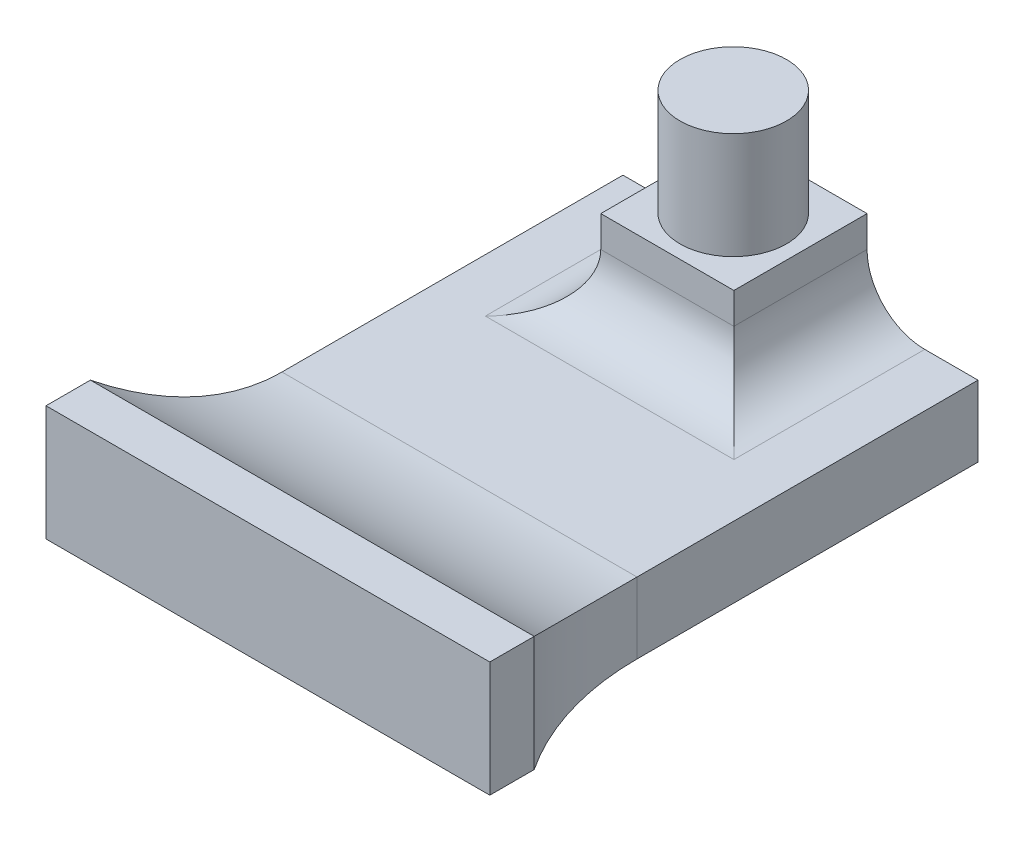
ISO-10303-21;
HEADER;
FILE_DESCRIPTION(('STEP AP214'),'2;1');
FILE_NAME('part.step','',(''),(''),'','','');
FILE_SCHEMA(('AUTOMOTIVE_DESIGN { 1 0 10303 214 1 1 1 1 }'));
ENDSEC;
DATA;
#1=APPLICATION_CONTEXT('core data for automotive mechanical design processes');
#2=APPLICATION_PROTOCOL_DEFINITION('international standard','automotive_design',2000,#1);
#3=PRODUCT_CONTEXT('',#1,'mechanical');
#4=PRODUCT('Part','Part','',(#3));
#5=PRODUCT_RELATED_PRODUCT_CATEGORY('part','',(#4));
#6=PRODUCT_DEFINITION_FORMATION('','',#4);
#7=PRODUCT_DEFINITION_CONTEXT('part definition',#1,'design');
#8=PRODUCT_DEFINITION('design','',#6,#7);
#9=PRODUCT_DEFINITION_SHAPE('','',#8);
#10=(LENGTH_UNIT() NAMED_UNIT(*) SI_UNIT(.MILLI.,.METRE.));
#11=(NAMED_UNIT(*) PLANE_ANGLE_UNIT() SI_UNIT($,.RADIAN.));
#12=(NAMED_UNIT(*) SI_UNIT($,.STERADIAN.) SOLID_ANGLE_UNIT());
#13=UNCERTAINTY_MEASURE_WITH_UNIT(LENGTH_MEASURE(1.E-05),#10,'distance_accuracy_value','');
#14=(GEOMETRIC_REPRESENTATION_CONTEXT(3) GLOBAL_UNCERTAINTY_ASSIGNED_CONTEXT((#13)) GLOBAL_UNIT_ASSIGNED_CONTEXT((#10,
#11,#12)) REPRESENTATION_CONTEXT('',''));
#15=CARTESIAN_POINT('',(0.,0.,0.));
#16=DIRECTION('',(0.,0.,1.));
#17=DIRECTION('',(1.,0.,0.));
#18=AXIS2_PLACEMENT_3D('',#15,#16,#17);
#19=CARTESIAN_POINT('',(-40.,0.,60.));
#20=DIRECTION('',(-1.,0.,0.));
#21=DIRECTION('',(0.,0.,1.));
#22=AXIS2_PLACEMENT_3D('',#19,#20,#21);
#23=PLANE('',#22);
#24=DIRECTION('',(0.,1.,0.));
#25=VECTOR('',#24,1.);
#26=CARTESIAN_POINT('',(-40.,0.,0.));
#27=LINE('',#26,#25);
#28=CARTESIAN_POINT('',(-40.,2.,0.));
#29=VERTEX_POINT('',#28);
#30=CARTESIAN_POINT('',(-40.,9.99999999999999,0.));
#31=VERTEX_POINT('',#30);
#32=EDGE_CURVE('E151',#29,#31,#27,.T.);
#33=ORIENTED_EDGE('',*,*,#32,.F.);
#34=DIRECTION('',(0.,0.,1.));
#35=VECTOR('',#34,1.);
#36=CARTESIAN_POINT('',(-40.,2.,60.));
#37=LINE('',#36,#35);
#38=CARTESIAN_POINT('',(-40.,1.99999999999999,38.416876048223));
#39=VERTEX_POINT('',#38);
#40=EDGE_CURVE('E141',#29,#39,#37,.T.);
#41=ORIENTED_EDGE('',*,*,#40,.T.);
#42=DIRECTION('',(0.,-1.,0.));
#43=VECTOR('',#42,1.);
#44=CARTESIAN_POINT('',(-40.,9.99999999999999,38.416876048223));
#45=LINE('',#44,#43);
#46=CARTESIAN_POINT('',(-40.,9.99999999999999,38.416876048223));
#47=VERTEX_POINT('',#46);
#48=EDGE_CURVE('E149',#39,#47,#45,.F.);
#49=ORIENTED_EDGE('',*,*,#48,.T.);
#50=DIRECTION('',(0.,0.,-1.));
#51=VECTOR('',#50,1.);
#52=CARTESIAN_POINT('',(-40.,9.99999999999999,60.));
#53=LINE('',#52,#51);
#54=EDGE_CURVE('E253',#47,#31,#53,.T.);
#55=ORIENTED_EDGE('',*,*,#54,.T.);
#56=EDGE_LOOP('',(#33,#41,#49,#55));
#57=FACE_BOUND('',#56,.T.);
#58=ADVANCED_FACE('F39',(#57),#23,.T.);
#59=CARTESIAN_POINT('',(0.,0.,60.));
#60=DIRECTION('',(-1.,0.,0.));
#61=DIRECTION('',(0.,-1.,0.));
#62=AXIS2_PLACEMENT_3D('',#59,#60,#61);
#63=PLANE('',#62);
#64=DIRECTION('',(0.,0.,1.));
#65=VECTOR('',#64,1.);
#66=CARTESIAN_POINT('',(0.,2.,60.));
#67=LINE('',#66,#65);
#68=CARTESIAN_POINT('',(0.,2.,0.));
#69=VERTEX_POINT('',#68);
#70=CARTESIAN_POINT('',(0.,2.,38.416876048223));
#71=VERTEX_POINT('',#70);
#72=EDGE_CURVE('E305',#69,#71,#67,.T.);
#73=ORIENTED_EDGE('',*,*,#72,.F.);
#74=DIRECTION('',(0.,1.,0.));
#75=VECTOR('',#74,1.);
#76=CARTESIAN_POINT('',(0.,0.,0.));
#77=LINE('',#76,#75);
#78=CARTESIAN_POINT('',(0.,10.,0.));
#79=VERTEX_POINT('',#78);
#80=EDGE_CURVE('E247',#69,#79,#77,.T.);
#81=ORIENTED_EDGE('',*,*,#80,.T.);
#82=DIRECTION('',(0.,0.,-1.));
#83=VECTOR('',#82,1.);
#84=CARTESIAN_POINT('',(0.,10.,60.));
#85=LINE('',#84,#83);
#86=CARTESIAN_POINT('',(0.,10.,38.416876048223));
#87=VERTEX_POINT('',#86);
#88=EDGE_CURVE('E250',#87,#79,#85,.T.);
#89=ORIENTED_EDGE('',*,*,#88,.F.);
#90=DIRECTION('',(0.,1.,0.));
#91=VECTOR('',#90,1.);
#92=CARTESIAN_POINT('',(0.,0.,38.416876048223));
#93=LINE('',#92,#91);
#94=EDGE_CURVE('E160',#87,#71,#93,.F.);
#95=ORIENTED_EDGE('',*,*,#94,.T.);
#96=EDGE_LOOP('',(#73,#81,#89,#95));
#97=FACE_BOUND('',#96,.T.);
#98=ADVANCED_FACE('F348',(#97),#63,.F.);
#99=CARTESIAN_POINT('',(0.,0.,60.));
#100=DIRECTION('',(0.,0.,-1.));
#101=DIRECTION('',(-1.,0.,0.));
#102=AXIS2_PLACEMENT_3D('',#99,#100,#101);
#103=PLANE('',#102);
#104=DIRECTION('',(-1.,0.,0.));
#105=VECTOR('',#104,1.);
#106=CARTESIAN_POINT('',(0.,2.,60.));
#107=LINE('',#106,#105);
#108=CARTESIAN_POINT('',(5.,2.,60.));
#109=VERTEX_POINT('',#108);
#110=CARTESIAN_POINT('',(-45.,1.99999999999999,60.));
#111=VERTEX_POINT('',#110);
#112=EDGE_CURVE('E154',#109,#111,#107,.T.);
#113=ORIENTED_EDGE('',*,*,#112,.F.);
#114=DIRECTION('',(0.,1.,0.));
#115=VECTOR('',#114,1.);
#116=CARTESIAN_POINT('',(5.,0.,60.));
#117=LINE('',#116,#115);
#118=CARTESIAN_POINT('',(5.,15.,60.));
#119=VERTEX_POINT('',#118);
#120=EDGE_CURVE('E186',#109,#119,#117,.T.);
#121=ORIENTED_EDGE('',*,*,#120,.T.);
#122=DIRECTION('',(1.,0.,0.));
#123=VECTOR('',#122,1.);
#124=CARTESIAN_POINT('',(-45.,15.,60.));
#125=LINE('',#124,#123);
#126=CARTESIAN_POINT('',(-45.,15.,60.));
#127=VERTEX_POINT('',#126);
#128=EDGE_CURVE('E180',#127,#119,#125,.T.);
#129=ORIENTED_EDGE('',*,*,#128,.F.);
#130=DIRECTION('',(0.,1.,0.));
#131=VECTOR('',#130,1.);
#132=CARTESIAN_POINT('',(-45.,0.,60.));
#133=LINE('',#132,#131);
#134=EDGE_CURVE('E193',#111,#127,#133,.T.);
#135=ORIENTED_EDGE('',*,*,#134,.F.);
#136=EDGE_LOOP('',(#113,#121,#129,#135));
#137=FACE_BOUND('',#136,.T.);
#138=ADVANCED_FACE('F354',(#137),#103,.F.);
#139=CARTESIAN_POINT('',(0.,0.,0.));
#140=DIRECTION('',(0.,0.,-1.));
#141=DIRECTION('',(-1.,0.,0.));
#142=AXIS2_PLACEMENT_3D('',#139,#140,#141);
#143=PLANE('',#142);
#144=ORIENTED_EDGE('',*,*,#80,.F.);
#145=DIRECTION('',(-1.,0.,0.));
#146=VECTOR('',#145,1.);
#147=CARTESIAN_POINT('',(0.,2.,0.));
#148=LINE('',#147,#146);
#149=EDGE_CURVE('E301',#69,#29,#148,.T.);
#150=ORIENTED_EDGE('',*,*,#149,.T.);
#151=ORIENTED_EDGE('',*,*,#32,.T.);
#152=DIRECTION('',(-1.,0.,0.));
#153=VECTOR('',#152,1.);
#154=CARTESIAN_POINT('',(0.,10.,0.));
#155=LINE('',#154,#153);
#156=CARTESIAN_POINT('',(-34.,9.99999999999999,0.));
#157=VERTEX_POINT('',#156);
#158=EDGE_CURVE('E229',#157,#31,#155,.T.);
#159=ORIENTED_EDGE('',*,*,#158,.F.);
#160=CARTESIAN_POINT('',(-34.,16.5,0.));
#161=DIRECTION('',(0.,0.,-1.));
#162=DIRECTION('',(-1.,0.,0.));
#163=AXIS2_PLACEMENT_3D('',#160,#161,#162);
#164=CIRCLE('',#163,6.5);
#165=CARTESIAN_POINT('',(-27.5,16.5,0.));
#166=VERTEX_POINT('',#165);
#167=EDGE_CURVE('E161',#157,#166,#164,.F.);
#168=ORIENTED_EDGE('',*,*,#167,.T.);
#169=DIRECTION('',(0.,-1.,0.));
#170=VECTOR('',#169,1.);
#171=CARTESIAN_POINT('',(-27.5,20.,0.));
#172=LINE('',#171,#170);
#173=CARTESIAN_POINT('',(-27.5,20.,0.));
#174=VERTEX_POINT('',#173);
#175=EDGE_CURVE('E234',#174,#166,#172,.T.);
#176=ORIENTED_EDGE('',*,*,#175,.F.);
#177=DIRECTION('',(-1.,0.,0.));
#178=VECTOR('',#177,1.);
#179=CARTESIAN_POINT('',(-12.5,20.,0.));
#180=LINE('',#179,#178);
#181=CARTESIAN_POINT('',(-12.5,20.,0.));
#182=VERTEX_POINT('',#181);
#183=EDGE_CURVE('E217',#182,#174,#180,.T.);
#184=ORIENTED_EDGE('',*,*,#183,.F.);
#185=DIRECTION('',(0.,-1.,0.));
#186=VECTOR('',#185,1.);
#187=CARTESIAN_POINT('',(-12.5,20.,0.));
#188=LINE('',#187,#186);
#189=CARTESIAN_POINT('',(-12.5,16.5,0.));
#190=VERTEX_POINT('',#189);
#191=EDGE_CURVE('E230',#182,#190,#188,.T.);
#192=ORIENTED_EDGE('',*,*,#191,.T.);
#193=CARTESIAN_POINT('',(-6.,16.5,0.));
#194=DIRECTION('',(0.,0.,-1.));
#195=DIRECTION('',(-1.,0.,0.));
#196=AXIS2_PLACEMENT_3D('',#193,#194,#195);
#197=CIRCLE('',#196,6.5);
#198=CARTESIAN_POINT('',(-6.,10.,0.));
#199=VERTEX_POINT('',#198);
#200=EDGE_CURVE('E167',#190,#199,#197,.F.);
#201=ORIENTED_EDGE('',*,*,#200,.T.);
#202=EDGE_CURVE('E241',#79,#199,#155,.T.);
#203=ORIENTED_EDGE('',*,*,#202,.F.);
#204=EDGE_LOOP('',(#144,#150,#151,#159,#168,#176,#184,#192,#201,#203));
#205=FACE_BOUND('',#204,.T.);
#206=ADVANCED_FACE('F298',(#205),#143,.T.);
#207=CARTESIAN_POINT('',(5.,0.,55.));
#208=DIRECTION('',(1.,0.,0.));
#209=DIRECTION('',(0.,1.,0.));
#210=AXIS2_PLACEMENT_3D('',#207,#208,#209);
#211=PLANE('',#210);
#212=ORIENTED_EDGE('',*,*,#120,.F.);
#213=DIRECTION('',(0.,0.,-1.));
#214=VECTOR('',#213,1.);
#215=CARTESIAN_POINT('',(5.,2.,55.));
#216=LINE('',#215,#214);
#217=CARTESIAN_POINT('',(5.,2.,55.));
#218=VERTEX_POINT('',#217);
#219=EDGE_CURVE('E153',#109,#218,#216,.T.);
#220=ORIENTED_EDGE('',*,*,#219,.T.);
#221=DIRECTION('',(0.,1.,0.));
#222=VECTOR('',#221,1.);
#223=CARTESIAN_POINT('',(5.,0.,55.));
#224=LINE('',#223,#222);
#225=CARTESIAN_POINT('',(5.,15.,55.));
#226=VERTEX_POINT('',#225);
#227=EDGE_CURVE('E323',#218,#226,#224,.T.);
#228=ORIENTED_EDGE('',*,*,#227,.T.);
#229=DIRECTION('',(0.,0.,1.));
#230=VECTOR('',#229,1.);
#231=CARTESIAN_POINT('',(5.,15.,55.));
#232=LINE('',#231,#230);
#233=EDGE_CURVE('E205',#226,#119,#232,.T.);
#234=ORIENTED_EDGE('',*,*,#233,.T.);
#235=EDGE_LOOP('',(#212,#220,#228,#234));
#236=FACE_BOUND('',#235,.T.);
#237=ADVANCED_FACE('F377',(#236),#211,.T.);
#238=CARTESIAN_POINT('',(-45.,0.,55.));
#239=DIRECTION('',(1.,0.,0.));
#240=DIRECTION('',(0.,0.,-1.));
#241=AXIS2_PLACEMENT_3D('',#238,#239,#240);
#242=PLANE('',#241);
#243=DIRECTION('',(0.,0.,-1.));
#244=VECTOR('',#243,1.);
#245=CARTESIAN_POINT('',(-45.,1.99999999999999,55.));
#246=LINE('',#245,#244);
#247=CARTESIAN_POINT('',(-45.,1.99999999999999,55.));
#248=VERTEX_POINT('',#247);
#249=EDGE_CURVE('E54',#111,#248,#246,.T.);
#250=ORIENTED_EDGE('',*,*,#249,.F.);
#251=ORIENTED_EDGE('',*,*,#134,.T.);
#252=DIRECTION('',(0.,0.,1.));
#253=VECTOR('',#252,1.);
#254=CARTESIAN_POINT('',(-45.,15.,55.));
#255=LINE('',#254,#253);
#256=CARTESIAN_POINT('',(-45.,15.,55.));
#257=VERTEX_POINT('',#256);
#258=EDGE_CURVE('E202',#257,#127,#255,.T.);
#259=ORIENTED_EDGE('',*,*,#258,.F.);
#260=DIRECTION('',(0.,1.,0.));
#261=VECTOR('',#260,1.);
#262=CARTESIAN_POINT('',(-45.,0.,55.));
#263=LINE('',#262,#261);
#264=EDGE_CURVE('E196',#248,#257,#263,.T.);
#265=ORIENTED_EDGE('',*,*,#264,.F.);
#266=EDGE_LOOP('',(#250,#251,#259,#265));
#267=FACE_BOUND('',#266,.T.);
#268=ADVANCED_FACE('F331',(#267),#242,.F.);
#269=CARTESIAN_POINT('',(30.,0.,38.416876048223));
#270=DIRECTION('',(0.,1.,0.));
#271=DIRECTION('',(-1.,0.,0.));
#272=AXIS2_PLACEMENT_3D('',#269,#270,#271);
#273=CYLINDRICAL_SURFACE('',#272,30.);
#274=CARTESIAN_POINT('',(30.,2.,38.416876048223));
#275=DIRECTION('',(0.,-1.,0.));
#276=DIRECTION('',(1.,0.,0.));
#277=AXIS2_PLACEMENT_3D('',#274,#275,#276);
#278=CIRCLE('',#277,30.);
#279=EDGE_CURVE('E309',#71,#218,#278,.F.);
#280=ORIENTED_EDGE('',*,*,#279,.F.);
#281=ORIENTED_EDGE('',*,*,#94,.F.);
#282=CARTESIAN_POINT('',(30.,40.,38.416876048223));
#283=DIRECTION('',(0.707106781186547,-0.707106781186548,0.));
#284=DIRECTION('',(0.707106781186548,0.707106781186547,0.));
#285=AXIS2_PLACEMENT_3D('',#282,#283,#284);
#286=ELLIPSE('',#285,42.4264068711929,30.);
#287=EDGE_CURVE('E176',#226,#87,#286,.T.);
#288=ORIENTED_EDGE('',*,*,#287,.F.);
#289=ORIENTED_EDGE('',*,*,#227,.F.);
#290=EDGE_LOOP('',(#280,#281,#288,#289));
#291=FACE_BOUND('',#290,.T.);
#292=ADVANCED_FACE('F41',(#291),#273,.F.);
#293=CARTESIAN_POINT('',(-70.,0.,38.416876048223));
#294=DIRECTION('',(0.,1.,0.));
#295=DIRECTION('',(0.,0.,1.));
#296=AXIS2_PLACEMENT_3D('',#293,#294,#295);
#297=CYLINDRICAL_SURFACE('',#296,30.);
#298=CARTESIAN_POINT('',(-70.,1.99999999999999,38.416876048223));
#299=DIRECTION('',(0.,-1.,0.));
#300=DIRECTION('',(1.,0.,0.));
#301=AXIS2_PLACEMENT_3D('',#298,#299,#300);
#302=CIRCLE('',#301,30.);
#303=EDGE_CURVE('E11',#248,#39,#302,.F.);
#304=ORIENTED_EDGE('',*,*,#303,.F.);
#305=ORIENTED_EDGE('',*,*,#264,.T.);
#306=CARTESIAN_POINT('',(-70.,40.,38.416876048223));
#307=DIRECTION('',(0.707106781186547,0.707106781186547,0.));
#308=DIRECTION('',(-0.707106781186547,0.707106781186547,0.));
#309=AXIS2_PLACEMENT_3D('',#306,#307,#308);
#310=ELLIPSE('',#309,42.4264068711928,30.);
#311=EDGE_CURVE('E158',#257,#47,#310,.T.);
#312=ORIENTED_EDGE('',*,*,#311,.T.);
#313=ORIENTED_EDGE('',*,*,#48,.F.);
#314=EDGE_LOOP('',(#304,#305,#312,#313));
#315=FACE_BOUND('',#314,.T.);
#316=ADVANCED_FACE('F156',(#315),#297,.F.);
#317=CARTESIAN_POINT('',(0.,10.,60.));
#318=DIRECTION('',(0.,-1.,0.));
#319=DIRECTION('',(1.,0.,0.));
#320=AXIS2_PLACEMENT_3D('',#317,#318,#319);
#321=PLANE('',#320);
#322=ORIENTED_EDGE('',*,*,#54,.F.);
#323=DIRECTION('',(1.,0.,0.));
#324=VECTOR('',#323,1.);
#325=CARTESIAN_POINT('',(0.,10.,38.416876048223));
#326=LINE('',#325,#324);
#327=EDGE_CURVE('E62',#47,#87,#326,.T.);
#328=ORIENTED_EDGE('',*,*,#327,.T.);
#329=ORIENTED_EDGE('',*,*,#88,.T.);
#330=ORIENTED_EDGE('',*,*,#202,.T.);
#331=DIRECTION('',(0.,0.,1.));
#332=VECTOR('',#331,1.);
#333=CARTESIAN_POINT('',(-5.99999999999999,10.,60.));
#334=LINE('',#333,#332);
#335=CARTESIAN_POINT('',(-6.,10.,21.5));
#336=VERTEX_POINT('',#335);
#337=EDGE_CURVE('E262',#199,#336,#334,.T.);
#338=ORIENTED_EDGE('',*,*,#337,.T.);
#339=DIRECTION('',(-1.,0.,0.));
#340=VECTOR('',#339,1.);
#341=CARTESIAN_POINT('',(0.,10.,21.5));
#342=LINE('',#341,#340);
#343=CARTESIAN_POINT('',(-34.,9.99999999999999,21.5));
#344=VERTEX_POINT('',#343);
#345=EDGE_CURVE('E259',#336,#344,#342,.T.);
#346=ORIENTED_EDGE('',*,*,#345,.T.);
#347=DIRECTION('',(0.,0.,1.));
#348=VECTOR('',#347,1.);
#349=CARTESIAN_POINT('',(-34.,9.99999999999999,0.));
#350=LINE('',#349,#348);
#351=EDGE_CURVE('E256',#344,#157,#350,.F.);
#352=ORIENTED_EDGE('',*,*,#351,.T.);
#353=ORIENTED_EDGE('',*,*,#158,.T.);
#354=EDGE_LOOP('',(#322,#328,#329,#330,#338,#346,#352,#353));
#355=FACE_BOUND('',#354,.T.);
#356=ADVANCED_FACE('F295',(#355),#321,.F.);
#357=CARTESIAN_POINT('',(-12.5,20.,15.));
#358=DIRECTION('',(0.,0.,1.));
#359=DIRECTION('',(1.,0.,0.));
#360=AXIS2_PLACEMENT_3D('',#357,#358,#359);
#361=PLANE('',#360);
#362=DIRECTION('',(0.,-1.,0.));
#363=VECTOR('',#362,1.);
#364=CARTESIAN_POINT('',(-27.5,20.,15.));
#365=LINE('',#364,#363);
#366=CARTESIAN_POINT('',(-27.5,20.,15.));
#367=VERTEX_POINT('',#366);
#368=CARTESIAN_POINT('',(-27.5,16.5,15.));
#369=VERTEX_POINT('',#368);
#370=EDGE_CURVE('E224',#367,#369,#365,.T.);
#371=ORIENTED_EDGE('',*,*,#370,.T.);
#372=DIRECTION('',(-1.,0.,0.));
#373=VECTOR('',#372,1.);
#374=CARTESIAN_POINT('',(-12.5,16.5,15.));
#375=LINE('',#374,#373);
#376=CARTESIAN_POINT('',(-12.5,16.5,15.));
#377=VERTEX_POINT('',#376);
#378=EDGE_CURVE('E269',#369,#377,#375,.F.);
#379=ORIENTED_EDGE('',*,*,#378,.T.);
#380=DIRECTION('',(0.,-1.,0.));
#381=VECTOR('',#380,1.);
#382=CARTESIAN_POINT('',(-12.5,20.,15.));
#383=LINE('',#382,#381);
#384=CARTESIAN_POINT('',(-12.5,20.,15.));
#385=VERTEX_POINT('',#384);
#386=EDGE_CURVE('E225',#385,#377,#383,.T.);
#387=ORIENTED_EDGE('',*,*,#386,.F.);
#388=DIRECTION('',(-1.,0.,0.));
#389=VECTOR('',#388,1.);
#390=CARTESIAN_POINT('',(-12.5,20.,15.));
#391=LINE('',#390,#389);
#392=EDGE_CURVE('E210',#385,#367,#391,.T.);
#393=ORIENTED_EDGE('',*,*,#392,.T.);
#394=EDGE_LOOP('',(#371,#379,#387,#393));
#395=FACE_BOUND('',#394,.T.);
#396=ADVANCED_FACE('F361',(#395),#361,.T.);
#397=CARTESIAN_POINT('',(-12.5,20.,0.));
#398=DIRECTION('',(1.,0.,0.));
#399=DIRECTION('',(0.,1.,0.));
#400=AXIS2_PLACEMENT_3D('',#397,#398,#399);
#401=PLANE('',#400);
#402=ORIENTED_EDGE('',*,*,#386,.T.);
#403=DIRECTION('',(0.,0.,1.));
#404=VECTOR('',#403,1.);
#405=CARTESIAN_POINT('',(-12.5,16.5,0.));
#406=LINE('',#405,#404);
#407=EDGE_CURVE('E266',#377,#190,#406,.F.);
#408=ORIENTED_EDGE('',*,*,#407,.T.);
#409=ORIENTED_EDGE('',*,*,#191,.F.);
#410=DIRECTION('',(0.,0.,1.));
#411=VECTOR('',#410,1.);
#412=CARTESIAN_POINT('',(-12.5,20.,0.));
#413=LINE('',#412,#411);
#414=EDGE_CURVE('E220',#182,#385,#413,.T.);
#415=ORIENTED_EDGE('',*,*,#414,.T.);
#416=EDGE_LOOP('',(#402,#408,#409,#415));
#417=FACE_BOUND('',#416,.T.);
#418=ADVANCED_FACE('F384',(#417),#401,.T.);
#419=CARTESIAN_POINT('',(-27.5,20.,0.));
#420=DIRECTION('',(1.,0.,0.));
#421=DIRECTION('',(0.,0.,-1.));
#422=AXIS2_PLACEMENT_3D('',#419,#420,#421);
#423=PLANE('',#422);
#424=ORIENTED_EDGE('',*,*,#175,.T.);
#425=DIRECTION('',(0.,0.,1.));
#426=VECTOR('',#425,1.);
#427=CARTESIAN_POINT('',(-27.5,16.5,15.));
#428=LINE('',#427,#426);
#429=EDGE_CURVE('E272',#166,#369,#428,.T.);
#430=ORIENTED_EDGE('',*,*,#429,.T.);
#431=ORIENTED_EDGE('',*,*,#370,.F.);
#432=DIRECTION('',(0.,0.,1.));
#433=VECTOR('',#432,1.);
#434=CARTESIAN_POINT('',(-27.5,20.,0.));
#435=LINE('',#434,#433);
#436=EDGE_CURVE('E214',#174,#367,#435,.T.);
#437=ORIENTED_EDGE('',*,*,#436,.F.);
#438=EDGE_LOOP('',(#424,#430,#431,#437));
#439=FACE_BOUND('',#438,.T.);
#440=ADVANCED_FACE('F392',(#439),#423,.F.);
#441=CARTESIAN_POINT('',(0.,20.,0.));
#442=DIRECTION('',(0.,1.,0.));
#443=DIRECTION('',(-1.,0.,0.));
#444=AXIS2_PLACEMENT_3D('',#441,#442,#443);
#445=PLANE('',#444);
#446=CARTESIAN_POINT('',(-20.0725056574811,20.,7.5));
#447=DIRECTION('',(0.,1.,0.));
#448=DIRECTION('',(-1.,0.,0.));
#449=AXIS2_PLACEMENT_3D('',#446,#447,#448);
#450=CIRCLE('',#449,6.);
#451=CARTESIAN_POINT('',(-26.0725056574811,20.,7.5));
#452=VERTEX_POINT('',#451);
#453=EDGE_CURVE('E48',#452,#452,#450,.T.);
#454=ORIENTED_EDGE('',*,*,#453,.F.);
#455=EDGE_LOOP('',(#454));
#456=FACE_BOUND('',#455,.T.);
#457=ORIENTED_EDGE('',*,*,#392,.F.);
#458=ORIENTED_EDGE('',*,*,#414,.F.);
#459=ORIENTED_EDGE('',*,*,#183,.T.);
#460=ORIENTED_EDGE('',*,*,#436,.T.);
#461=EDGE_LOOP('',(#457,#458,#459,#460));
#462=FACE_BOUND('',#461,.T.);
#463=ADVANCED_FACE('F367',(#456,#462),#445,.T.);
#464=CARTESIAN_POINT('',(-34.,16.5,0.));
#465=DIRECTION('',(0.,0.,-1.));
#466=DIRECTION('',(-1.,0.,0.));
#467=AXIS2_PLACEMENT_3D('',#464,#465,#466);
#468=CYLINDRICAL_SURFACE('',#467,6.5);
#469=ORIENTED_EDGE('',*,*,#167,.F.);
#470=ORIENTED_EDGE('',*,*,#351,.F.);
#471=CARTESIAN_POINT('',(-34.,16.5,21.5));
#472=DIRECTION('',(-0.707106781186548,0.,-0.707106781186547));
#473=DIRECTION('',(0.707106781186547,0.,-0.707106781186548));
#474=AXIS2_PLACEMENT_3D('',#471,#472,#473);
#475=ELLIPSE('',#474,9.19238815542512,6.5);
#476=EDGE_CURVE('E170',#369,#344,#475,.T.);
#477=ORIENTED_EDGE('',*,*,#476,.F.);
#478=ORIENTED_EDGE('',*,*,#429,.F.);
#479=EDGE_LOOP('',(#469,#470,#477,#478));
#480=FACE_BOUND('',#479,.T.);
#481=ADVANCED_FACE('F292',(#480),#468,.F.);
#482=CARTESIAN_POINT('',(0.,16.5,21.5));
#483=DIRECTION('',(-1.,0.,0.));
#484=DIRECTION('',(0.,0.,1.));
#485=AXIS2_PLACEMENT_3D('',#482,#483,#484);
#486=CYLINDRICAL_SURFACE('',#485,6.5);
#487=ORIENTED_EDGE('',*,*,#476,.T.);
#488=ORIENTED_EDGE('',*,*,#345,.F.);
#489=CARTESIAN_POINT('',(-6.,16.5,21.5));
#490=DIRECTION('',(-0.707106781186547,0.,0.707106781186548));
#491=DIRECTION('',(-0.707106781186548,0.,-0.707106781186547));
#492=AXIS2_PLACEMENT_3D('',#489,#490,#491);
#493=ELLIPSE('',#492,9.19238815542512,6.5);
#494=EDGE_CURVE('E209',#377,#336,#493,.T.);
#495=ORIENTED_EDGE('',*,*,#494,.F.);
#496=ORIENTED_EDGE('',*,*,#378,.F.);
#497=EDGE_LOOP('',(#487,#488,#495,#496));
#498=FACE_BOUND('',#497,.T.);
#499=ADVANCED_FACE('F287',(#498),#486,.F.);
#500=CARTESIAN_POINT('',(-5.99999999999999,16.5,60.));
#501=DIRECTION('',(0.,0.,1.));
#502=DIRECTION('',(1.,0.,0.));
#503=AXIS2_PLACEMENT_3D('',#500,#501,#502);
#504=CYLINDRICAL_SURFACE('',#503,6.5);
#505=ORIENTED_EDGE('',*,*,#200,.F.);
#506=ORIENTED_EDGE('',*,*,#407,.F.);
#507=ORIENTED_EDGE('',*,*,#494,.T.);
#508=ORIENTED_EDGE('',*,*,#337,.F.);
#509=EDGE_LOOP('',(#505,#506,#507,#508));
#510=FACE_BOUND('',#509,.T.);
#511=ADVANCED_FACE('F344',(#510),#504,.F.);
#512=CARTESIAN_POINT('',(-45.,15.,55.));
#513=DIRECTION('',(0.,-1.,0.));
#514=DIRECTION('',(0.,0.,-1.));
#515=AXIS2_PLACEMENT_3D('',#512,#513,#514);
#516=PLANE('',#515);
#517=ORIENTED_EDGE('',*,*,#128,.T.);
#518=ORIENTED_EDGE('',*,*,#233,.F.);
#519=DIRECTION('',(1.,0.,0.));
#520=VECTOR('',#519,1.);
#521=CARTESIAN_POINT('',(-45.,15.,55.));
#522=LINE('',#521,#520);
#523=EDGE_CURVE('E201',#257,#226,#522,.T.);
#524=ORIENTED_EDGE('',*,*,#523,.F.);
#525=ORIENTED_EDGE('',*,*,#258,.T.);
#526=EDGE_LOOP('',(#517,#518,#524,#525));
#527=FACE_BOUND('',#526,.T.);
#528=ADVANCED_FACE('F333',(#527),#516,.F.);
#529=CARTESIAN_POINT('',(0.,40.,38.416876048223));
#530=DIRECTION('',(1.,0.,0.));
#531=DIRECTION('',(0.,0.,-1.));
#532=AXIS2_PLACEMENT_3D('',#529,#530,#531);
#533=CYLINDRICAL_SURFACE('',#532,30.);
#534=ORIENTED_EDGE('',*,*,#287,.T.);
#535=ORIENTED_EDGE('',*,*,#327,.F.);
#536=ORIENTED_EDGE('',*,*,#311,.F.);
#537=ORIENTED_EDGE('',*,*,#523,.T.);
#538=EDGE_LOOP('',(#534,#535,#536,#537));
#539=FACE_BOUND('',#538,.T.);
#540=ADVANCED_FACE('F334',(#539),#533,.F.);
#541=CARTESIAN_POINT('',(-20.0725056574811,32.,7.5));
#542=DIRECTION('',(0.,-1.,0.));
#543=DIRECTION('',(1.,0.,0.));
#544=AXIS2_PLACEMENT_3D('',#541,#542,#543);
#545=CYLINDRICAL_SURFACE('',#544,6.);
#546=CARTESIAN_POINT('',(-20.0725056574811,32.,7.5));
#547=DIRECTION('',(0.,1.,0.));
#548=DIRECTION('',(-1.,0.,0.));
#549=AXIS2_PLACEMENT_3D('',#546,#547,#548);
#550=CIRCLE('',#549,6.);
#551=CARTESIAN_POINT('',(-26.0725056574811,32.,7.5));
#552=VERTEX_POINT('',#551);
#553=EDGE_CURVE('E177',#552,#552,#550,.T.);
#554=ORIENTED_EDGE('',*,*,#553,.F.);
#555=EDGE_LOOP('',(#554));
#556=FACE_BOUND('',#555,.T.);
#557=ORIENTED_EDGE('',*,*,#453,.T.);
#558=EDGE_LOOP('',(#557));
#559=FACE_BOUND('',#558,.T.);
#560=ADVANCED_FACE('F336',(#556,#559),#545,.T.);
#561=CARTESIAN_POINT('',(-20.0725056574811,32.,7.5));
#562=DIRECTION('',(0.,1.,0.));
#563=DIRECTION('',(-1.,0.,0.));
#564=AXIS2_PLACEMENT_3D('',#561,#562,#563);
#565=PLANE('',#564);
#566=ORIENTED_EDGE('',*,*,#553,.T.);
#567=EDGE_LOOP('',(#566));
#568=FACE_BOUND('',#567,.T.);
#569=ADVANCED_FACE('F341',(#568),#565,.T.);
#570=CARTESIAN_POINT('',(0.,2.,0.));
#571=DIRECTION('',(0.,-1.,0.));
#572=DIRECTION('',(1.,0.,0.));
#573=AXIS2_PLACEMENT_3D('',#570,#571,#572);
#574=PLANE('',#573);
#575=ORIENTED_EDGE('',*,*,#279,.T.);
#576=ORIENTED_EDGE('',*,*,#219,.F.);
#577=ORIENTED_EDGE('',*,*,#112,.T.);
#578=ORIENTED_EDGE('',*,*,#249,.T.);
#579=ORIENTED_EDGE('',*,*,#303,.T.);
#580=ORIENTED_EDGE('',*,*,#40,.F.);
#581=ORIENTED_EDGE('',*,*,#149,.F.);
#582=ORIENTED_EDGE('',*,*,#72,.T.);
#583=EDGE_LOOP('',(#575,#576,#577,#578,#579,#580,#581,#582));
#584=FACE_BOUND('',#583,.T.);
#585=ADVANCED_FACE('F140',(#584),#574,.T.);
#586=CLOSED_SHELL('',(#58,#98,#138,#206,#237,#268,#292,#316,#356,#396,#418,#440,#463,#481,#499,
#511,#528,#540,#560,#569,#585));
#587=MANIFOLD_SOLID_BREP('B2',#586);
#588=ADVANCED_BREP_SHAPE_REPRESENTATION('',(#18,#587),#14);
#589=SHAPE_DEFINITION_REPRESENTATION(#9,#588);
ENDSEC;
END-ISO-10303-21;
